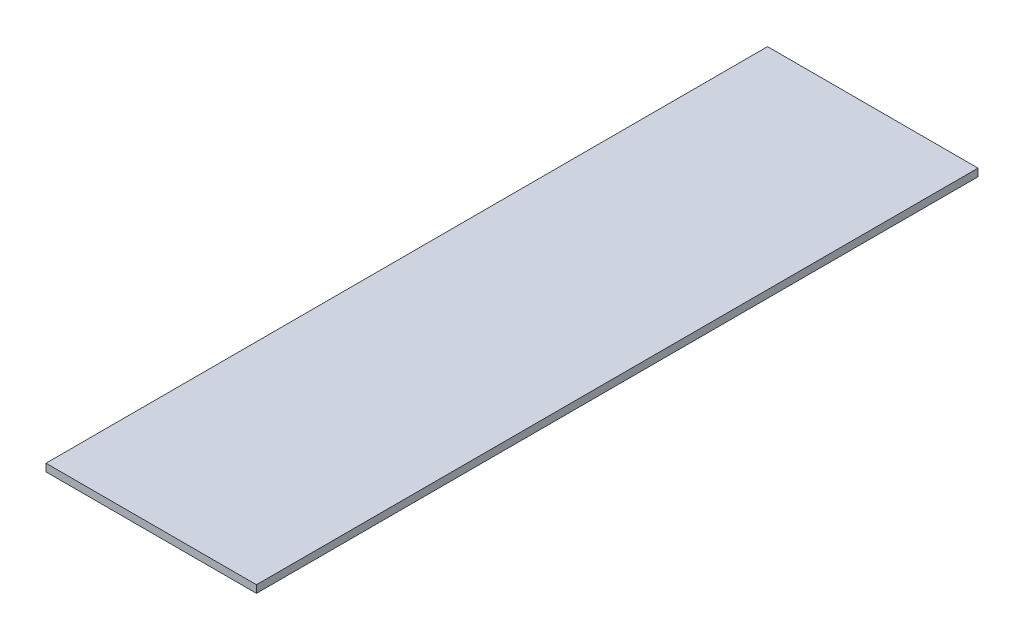
ISO-10303-21;
HEADER;
FILE_DESCRIPTION(('STEP AP214'),'2;1');
FILE_NAME('part.step','',(''),(''),'','','');
FILE_SCHEMA(('AUTOMOTIVE_DESIGN { 1 0 10303 214 1 1 1 1 }'));
ENDSEC;
DATA;
#1=APPLICATION_CONTEXT('core data for automotive mechanical design processes');
#2=APPLICATION_PROTOCOL_DEFINITION('international standard','automotive_design',2000,#1);
#3=PRODUCT_CONTEXT('',#1,'mechanical');
#4=PRODUCT('Part','Part','',(#3));
#5=PRODUCT_RELATED_PRODUCT_CATEGORY('part','',(#4));
#6=PRODUCT_DEFINITION_FORMATION('','',#4);
#7=PRODUCT_DEFINITION_CONTEXT('part definition',#1,'design');
#8=PRODUCT_DEFINITION('design','',#6,#7);
#9=PRODUCT_DEFINITION_SHAPE('','',#8);
#10=(LENGTH_UNIT() NAMED_UNIT(*) SI_UNIT(.MILLI.,.METRE.));
#11=(NAMED_UNIT(*) PLANE_ANGLE_UNIT() SI_UNIT($,.RADIAN.));
#12=(NAMED_UNIT(*) SI_UNIT($,.STERADIAN.) SOLID_ANGLE_UNIT());
#13=UNCERTAINTY_MEASURE_WITH_UNIT(LENGTH_MEASURE(1.E-05),#10,'distance_accuracy_value','');
#14=(GEOMETRIC_REPRESENTATION_CONTEXT(3) GLOBAL_UNCERTAINTY_ASSIGNED_CONTEXT((#13)) GLOBAL_UNIT_ASSIGNED_CONTEXT((#10,
#11,#12)) REPRESENTATION_CONTEXT('',''));
#15=CARTESIAN_POINT('',(0.,0.,0.));
#16=DIRECTION('',(0.,0.,1.));
#17=DIRECTION('',(1.,0.,0.));
#18=AXIS2_PLACEMENT_3D('',#15,#16,#17);
#19=CARTESIAN_POINT('',(-177.8,-12.7,-939.8));
#20=DIRECTION('',(-1.,0.,0.));
#21=DIRECTION('',(0.,0.,1.));
#22=AXIS2_PLACEMENT_3D('',#19,#20,#21);
#23=PLANE('',#22);
#24=DIRECTION('',(0.,0.,1.));
#25=VECTOR('',#24,1.);
#26=CARTESIAN_POINT('',(-177.8,0.,-939.8));
#27=LINE('',#26,#25);
#28=CARTESIAN_POINT('',(-177.8,0.,-939.8));
#29=VERTEX_POINT('',#28);
#30=CARTESIAN_POINT('',(-177.8,0.,279.4));
#31=VERTEX_POINT('',#30);
#32=EDGE_CURVE('E97',#29,#31,#27,.T.);
#33=ORIENTED_EDGE('',*,*,#32,.F.);
#34=DIRECTION('',(0.,1.,0.));
#35=VECTOR('',#34,1.);
#36=CARTESIAN_POINT('',(-177.8,-12.7,-939.8));
#37=LINE('',#36,#35);
#38=CARTESIAN_POINT('',(-177.8,-12.7,-939.8));
#39=VERTEX_POINT('',#38);
#40=EDGE_CURVE('E11',#39,#29,#37,.T.);
#41=ORIENTED_EDGE('',*,*,#40,.F.);
#42=DIRECTION('',(0.,0.,1.));
#43=VECTOR('',#42,1.);
#44=CARTESIAN_POINT('',(-177.8,-12.7,-939.8));
#45=LINE('',#44,#43);
#46=CARTESIAN_POINT('',(-177.8,-12.7,279.4));
#47=VERTEX_POINT('',#46);
#48=EDGE_CURVE('E91',#39,#47,#45,.T.);
#49=ORIENTED_EDGE('',*,*,#48,.T.);
#50=DIRECTION('',(0.,1.,0.));
#51=VECTOR('',#50,1.);
#52=CARTESIAN_POINT('',(-177.8,-12.7,279.4));
#53=LINE('',#52,#51);
#54=EDGE_CURVE('E36',#47,#31,#53,.T.);
#55=ORIENTED_EDGE('',*,*,#54,.T.);
#56=EDGE_LOOP('',(#33,#41,#49,#55));
#57=FACE_BOUND('',#56,.T.);
#58=ADVANCED_FACE('F33',(#57),#23,.T.);
#59=CARTESIAN_POINT('',(-177.8,-12.7,-939.8));
#60=DIRECTION('',(0.,0.,-1.));
#61=DIRECTION('',(-1.,0.,0.));
#62=AXIS2_PLACEMENT_3D('',#59,#60,#61);
#63=PLANE('',#62);
#64=DIRECTION('',(-1.,0.,0.));
#65=VECTOR('',#64,1.);
#66=CARTESIAN_POINT('',(-177.8,0.,-939.8));
#67=LINE('',#66,#65);
#68=CARTESIAN_POINT('',(177.8,0.,-939.8));
#69=VERTEX_POINT('',#68);
#70=EDGE_CURVE('E93',#69,#29,#67,.T.);
#71=ORIENTED_EDGE('',*,*,#70,.F.);
#72=DIRECTION('',(0.,1.,0.));
#73=VECTOR('',#72,1.);
#74=CARTESIAN_POINT('',(177.8,-12.7,-939.8));
#75=LINE('',#74,#73);
#76=CARTESIAN_POINT('',(177.8,-12.7,-939.8));
#77=VERTEX_POINT('',#76);
#78=EDGE_CURVE('E42',#77,#69,#75,.T.);
#79=ORIENTED_EDGE('',*,*,#78,.F.);
#80=DIRECTION('',(-1.,0.,0.));
#81=VECTOR('',#80,1.);
#82=CARTESIAN_POINT('',(-177.8,-12.7,-939.8));
#83=LINE('',#82,#81);
#84=EDGE_CURVE('E88',#77,#39,#83,.T.);
#85=ORIENTED_EDGE('',*,*,#84,.T.);
#86=ORIENTED_EDGE('',*,*,#40,.T.);
#87=EDGE_LOOP('',(#71,#79,#85,#86));
#88=FACE_BOUND('',#87,.T.);
#89=ADVANCED_FACE('F107',(#88),#63,.T.);
#90=CARTESIAN_POINT('',(177.8,-12.7,-939.8));
#91=DIRECTION('',(1.,0.,0.));
#92=DIRECTION('',(0.,0.,-1.));
#93=AXIS2_PLACEMENT_3D('',#90,#91,#92);
#94=PLANE('',#93);
#95=DIRECTION('',(0.,0.,-1.));
#96=VECTOR('',#95,1.);
#97=CARTESIAN_POINT('',(177.8,0.,-939.8));
#98=LINE('',#97,#96);
#99=CARTESIAN_POINT('',(177.8,0.,279.4));
#100=VERTEX_POINT('',#99);
#101=EDGE_CURVE('E83',#100,#69,#98,.T.);
#102=ORIENTED_EDGE('',*,*,#101,.F.);
#103=DIRECTION('',(0.,1.,0.));
#104=VECTOR('',#103,1.);
#105=CARTESIAN_POINT('',(177.8,-12.7,279.4));
#106=LINE('',#105,#104);
#107=CARTESIAN_POINT('',(177.8,-12.7,279.4));
#108=VERTEX_POINT('',#107);
#109=EDGE_CURVE('E78',#108,#100,#106,.T.);
#110=ORIENTED_EDGE('',*,*,#109,.F.);
#111=DIRECTION('',(0.,0.,-1.));
#112=VECTOR('',#111,1.);
#113=CARTESIAN_POINT('',(177.8,-12.7,-939.8));
#114=LINE('',#113,#112);
#115=EDGE_CURVE('E81',#108,#77,#114,.T.);
#116=ORIENTED_EDGE('',*,*,#115,.T.);
#117=ORIENTED_EDGE('',*,*,#78,.T.);
#118=EDGE_LOOP('',(#102,#110,#116,#117));
#119=FACE_BOUND('',#118,.T.);
#120=ADVANCED_FACE('F80',(#119),#94,.T.);
#121=CARTESIAN_POINT('',(-177.8,-12.7,279.4));
#122=DIRECTION('',(0.,0.,1.));
#123=DIRECTION('',(1.,0.,0.));
#124=AXIS2_PLACEMENT_3D('',#121,#122,#123);
#125=PLANE('',#124);
#126=DIRECTION('',(1.,0.,0.));
#127=VECTOR('',#126,1.);
#128=CARTESIAN_POINT('',(-177.8,0.,279.4));
#129=LINE('',#128,#127);
#130=EDGE_CURVE('E100',#31,#100,#129,.T.);
#131=ORIENTED_EDGE('',*,*,#130,.F.);
#132=ORIENTED_EDGE('',*,*,#54,.F.);
#133=DIRECTION('',(1.,0.,0.));
#134=VECTOR('',#133,1.);
#135=CARTESIAN_POINT('',(-177.8,-12.7,279.4));
#136=LINE('',#135,#134);
#137=EDGE_CURVE('E87',#47,#108,#136,.T.);
#138=ORIENTED_EDGE('',*,*,#137,.T.);
#139=ORIENTED_EDGE('',*,*,#109,.T.);
#140=EDGE_LOOP('',(#131,#132,#138,#139));
#141=FACE_BOUND('',#140,.T.);
#142=ADVANCED_FACE('F90',(#141),#125,.T.);
#143=CARTESIAN_POINT('',(0.,-12.7,0.));
#144=DIRECTION('',(0.,1.,0.));
#145=DIRECTION('',(0.,0.,1.));
#146=AXIS2_PLACEMENT_3D('',#143,#144,#145);
#147=PLANE('',#146);
#148=ORIENTED_EDGE('',*,*,#48,.F.);
#149=ORIENTED_EDGE('',*,*,#84,.F.);
#150=ORIENTED_EDGE('',*,*,#115,.F.);
#151=ORIENTED_EDGE('',*,*,#137,.F.);
#152=EDGE_LOOP('',(#148,#149,#150,#151));
#153=FACE_BOUND('',#152,.T.);
#154=ADVANCED_FACE('F86',(#153),#147,.F.);
#155=CARTESIAN_POINT('',(0.,0.,0.));
#156=DIRECTION('',(0.,1.,0.));
#157=DIRECTION('',(0.,0.,1.));
#158=AXIS2_PLACEMENT_3D('',#155,#156,#157);
#159=PLANE('',#158);
#160=ORIENTED_EDGE('',*,*,#32,.T.);
#161=ORIENTED_EDGE('',*,*,#130,.T.);
#162=ORIENTED_EDGE('',*,*,#101,.T.);
#163=ORIENTED_EDGE('',*,*,#70,.T.);
#164=EDGE_LOOP('',(#160,#161,#162,#163));
#165=FACE_BOUND('',#164,.T.);
#166=ADVANCED_FACE('F106',(#165),#159,.T.);
#167=CLOSED_SHELL('',(#58,#89,#120,#142,#154,#166));
#168=MANIFOLD_SOLID_BREP('B2',#167);
#169=ADVANCED_BREP_SHAPE_REPRESENTATION('',(#18,#168),#14);
#170=SHAPE_DEFINITION_REPRESENTATION(#9,#169);
ENDSEC;
END-ISO-10303-21;
